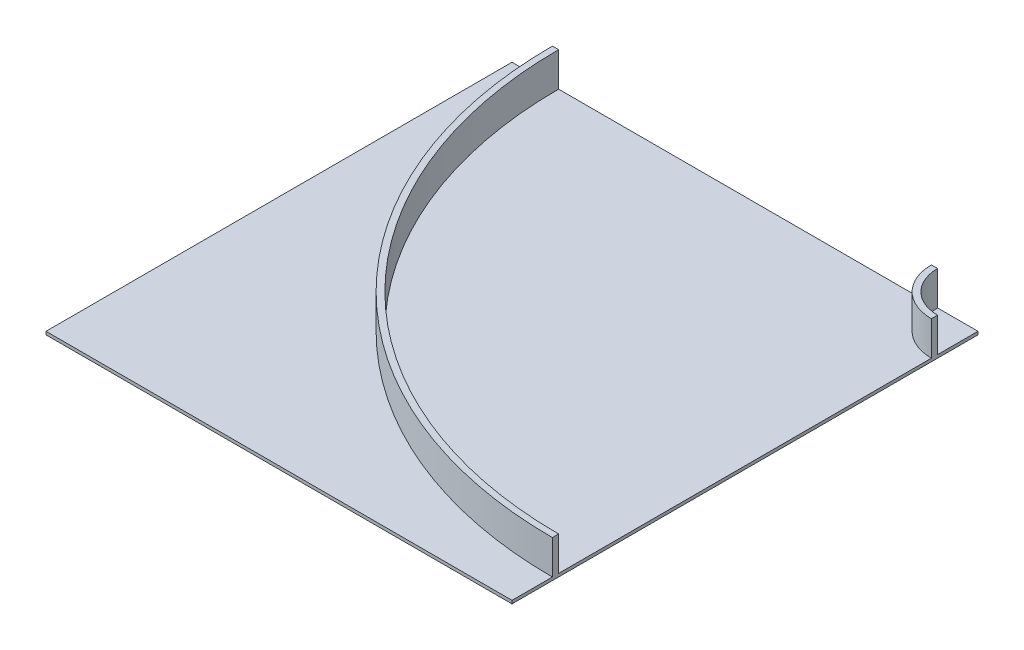
ISO-10303-21;
HEADER;
FILE_DESCRIPTION(('STEP AP214'),'2;1');
FILE_NAME('part.step','',(''),(''),'','','');
FILE_SCHEMA(('AUTOMOTIVE_DESIGN { 1 0 10303 214 1 1 1 1 }'));
ENDSEC;
DATA;
#1=APPLICATION_CONTEXT('core data for automotive mechanical design processes');
#2=APPLICATION_PROTOCOL_DEFINITION('international standard','automotive_design',2000,#1);
#3=PRODUCT_CONTEXT('',#1,'mechanical');
#4=PRODUCT('Part','Part','',(#3));
#5=PRODUCT_RELATED_PRODUCT_CATEGORY('part','',(#4));
#6=PRODUCT_DEFINITION_FORMATION('','',#4);
#7=PRODUCT_DEFINITION_CONTEXT('part definition',#1,'design');
#8=PRODUCT_DEFINITION('design','',#6,#7);
#9=PRODUCT_DEFINITION_SHAPE('','',#8);
#10=(LENGTH_UNIT() NAMED_UNIT(*) SI_UNIT(.MILLI.,.METRE.));
#11=(NAMED_UNIT(*) PLANE_ANGLE_UNIT() SI_UNIT($,.RADIAN.));
#12=(NAMED_UNIT(*) SI_UNIT($,.STERADIAN.) SOLID_ANGLE_UNIT());
#13=UNCERTAINTY_MEASURE_WITH_UNIT(LENGTH_MEASURE(1.E-05),#10,'distance_accuracy_value','');
#14=(GEOMETRIC_REPRESENTATION_CONTEXT(3) GLOBAL_UNCERTAINTY_ASSIGNED_CONTEXT((#13)) GLOBAL_UNIT_ASSIGNED_CONTEXT((#10,
#11,#12)) REPRESENTATION_CONTEXT('',''));
#15=CARTESIAN_POINT('',(0.,0.,0.));
#16=DIRECTION('',(0.,0.,1.));
#17=DIRECTION('',(1.,0.,0.));
#18=AXIS2_PLACEMENT_3D('',#15,#16,#17);
#19=CARTESIAN_POINT('',(0.,10.,0.));
#20=DIRECTION('',(0.,1.,0.));
#21=DIRECTION('',(0.,0.,1.));
#22=AXIS2_PLACEMENT_3D('',#19,#20,#21);
#23=PLANE('',#22);
#24=DIRECTION('',(0.,0.,-1.));
#25=VECTOR('',#24,1.);
#26=CARTESIAN_POINT('',(750.,10.,-750.));
#27=LINE('',#26,#25);
#28=CARTESIAN_POINT('',(750.,10.,599.999999999999));
#29=VERTEX_POINT('',#28);
#30=CARTESIAN_POINT('',(750.,10.,-600.));
#31=VERTEX_POINT('',#30);
#32=EDGE_CURVE('E88',#29,#31,#27,.T.);
#33=ORIENTED_EDGE('',*,*,#32,.T.);
#34=CARTESIAN_POINT('',(750.,10.,-750.));
#35=DIRECTION('',(0.,1.,0.));
#36=DIRECTION('',(0.,0.,1.));
#37=AXIS2_PLACEMENT_3D('',#34,#35,#36);
#38=CIRCLE('',#37,150.);
#39=CARTESIAN_POINT('',(600.,10.,-750.));
#40=VERTEX_POINT('',#39);
#41=EDGE_CURVE('E178',#40,#31,#38,.T.);
#42=ORIENTED_EDGE('',*,*,#41,.F.);
#43=DIRECTION('',(-1.,0.,0.));
#44=VECTOR('',#43,1.);
#45=CARTESIAN_POINT('',(-750.,10.,-750.));
#46=LINE('',#45,#44);
#47=CARTESIAN_POINT('',(-600.,10.,-750.));
#48=VERTEX_POINT('',#47);
#49=EDGE_CURVE('E233',#40,#48,#46,.T.);
#50=ORIENTED_EDGE('',*,*,#49,.T.);
#51=CARTESIAN_POINT('',(750.,10.,-750.));
#52=DIRECTION('',(0.,1.,0.));
#53=DIRECTION('',(0.,0.,1.));
#54=AXIS2_PLACEMENT_3D('',#51,#52,#53);
#55=CIRCLE('',#54,1350.);
#56=EDGE_CURVE('E195',#48,#29,#55,.T.);
#57=ORIENTED_EDGE('',*,*,#56,.T.);
#58=EDGE_LOOP('',(#33,#42,#50,#57));
#59=FACE_BOUND('',#58,.T.);
#60=ADVANCED_FACE('F62',(#59),#23,.T.);
#61=CARTESIAN_POINT('',(750.,10.,-750.));
#62=DIRECTION('',(0.,1.,0.));
#63=DIRECTION('',(0.,0.,1.));
#64=AXIS2_PLACEMENT_3D('',#61,#62,#63);
#65=CIRCLE('',#64,130.);
#66=CARTESIAN_POINT('',(620.,10.,-750.));
#67=VERTEX_POINT('',#66);
#68=CARTESIAN_POINT('',(750.,10.,-620.));
#69=VERTEX_POINT('',#68);
#70=EDGE_CURVE('E80',#67,#69,#65,.T.);
#71=ORIENTED_EDGE('',*,*,#70,.T.);
#72=CARTESIAN_POINT('',(750.,10.,-750.));
#73=VERTEX_POINT('',#72);
#74=EDGE_CURVE('E66',#69,#73,#27,.T.);
#75=ORIENTED_EDGE('',*,*,#74,.T.);
#76=EDGE_CURVE('E234',#73,#67,#46,.T.);
#77=ORIENTED_EDGE('',*,*,#76,.T.);
#78=EDGE_LOOP('',(#71,#75,#77));
#79=FACE_BOUND('',#78,.T.);
#80=ADVANCED_FACE('F289',(#79),#23,.T.);
#81=CARTESIAN_POINT('',(750.,10.,-750.));
#82=DIRECTION('',(-1.,0.,0.));
#83=DIRECTION('',(0.,0.,1.));
#84=AXIS2_PLACEMENT_3D('',#81,#82,#83);
#85=PLANE('',#84);
#86=DIRECTION('',(0.,0.,-1.));
#87=VECTOR('',#86,1.);
#88=CARTESIAN_POINT('',(750.,0.,-750.));
#89=LINE('',#88,#87);
#90=CARTESIAN_POINT('',(750.,0.,750.));
#91=VERTEX_POINT('',#90);
#92=CARTESIAN_POINT('',(750.,0.,-750.));
#93=VERTEX_POINT('',#92);
#94=EDGE_CURVE('E222',#91,#93,#89,.T.);
#95=ORIENTED_EDGE('',*,*,#94,.T.);
#96=DIRECTION('',(0.,-1.,0.));
#97=VECTOR('',#96,1.);
#98=CARTESIAN_POINT('',(750.,10.,-750.));
#99=LINE('',#98,#97);
#100=EDGE_CURVE('E12',#73,#93,#99,.T.);
#101=ORIENTED_EDGE('',*,*,#100,.F.);
#102=ORIENTED_EDGE('',*,*,#74,.F.);
#103=DIRECTION('',(0.,-1.,0.));
#104=VECTOR('',#103,1.);
#105=CARTESIAN_POINT('',(750.,120.,-620.));
#106=LINE('',#105,#104);
#107=CARTESIAN_POINT('',(750.,120.,-620.));
#108=VERTEX_POINT('',#107);
#109=EDGE_CURVE('E184',#108,#69,#106,.T.);
#110=ORIENTED_EDGE('',*,*,#109,.F.);
#111=DIRECTION('',(0.,0.,-1.));
#112=VECTOR('',#111,1.);
#113=CARTESIAN_POINT('',(750.,120.,-1.11022302462516E-13));
#114=LINE('',#113,#112);
#115=CARTESIAN_POINT('',(750.,120.,-600.));
#116=VERTEX_POINT('',#115);
#117=EDGE_CURVE('E176',#116,#108,#114,.T.);
#118=ORIENTED_EDGE('',*,*,#117,.F.);
#119=DIRECTION('',(0.,-1.,0.));
#120=VECTOR('',#119,1.);
#121=CARTESIAN_POINT('',(750.,120.,-600.));
#122=LINE('',#121,#120);
#123=EDGE_CURVE('E187',#116,#31,#122,.T.);
#124=ORIENTED_EDGE('',*,*,#123,.T.);
#125=ORIENTED_EDGE('',*,*,#32,.F.);
#126=DIRECTION('',(0.,-1.,0.));
#127=VECTOR('',#126,1.);
#128=CARTESIAN_POINT('',(750.,120.,599.999999999999));
#129=LINE('',#128,#127);
#130=CARTESIAN_POINT('',(750.,120.,599.999999999999));
#131=VERTEX_POINT('',#130);
#132=EDGE_CURVE('E217',#131,#29,#129,.T.);
#133=ORIENTED_EDGE('',*,*,#132,.F.);
#134=DIRECTION('',(0.,0.,-1.));
#135=VECTOR('',#134,1.);
#136=CARTESIAN_POINT('',(750.,120.,-1.11022302462516E-13));
#137=LINE('',#136,#135);
#138=CARTESIAN_POINT('',(750.,120.,620.));
#139=VERTEX_POINT('',#138);
#140=EDGE_CURVE('E197',#139,#131,#137,.T.);
#141=ORIENTED_EDGE('',*,*,#140,.F.);
#142=DIRECTION('',(0.,-1.,0.));
#143=VECTOR('',#142,1.);
#144=CARTESIAN_POINT('',(750.,120.,620.));
#145=LINE('',#144,#143);
#146=CARTESIAN_POINT('',(750.,10.,620.));
#147=VERTEX_POINT('',#146);
#148=EDGE_CURVE('E213',#139,#147,#145,.T.);
#149=ORIENTED_EDGE('',*,*,#148,.T.);
#150=CARTESIAN_POINT('',(750.,10.,750.));
#151=VERTEX_POINT('',#150);
#152=EDGE_CURVE('E244',#151,#147,#27,.T.);
#153=ORIENTED_EDGE('',*,*,#152,.F.);
#154=DIRECTION('',(0.,-1.,0.));
#155=VECTOR('',#154,1.);
#156=CARTESIAN_POINT('',(750.,10.,750.));
#157=LINE('',#156,#155);
#158=EDGE_CURVE('E251',#151,#91,#157,.T.);
#159=ORIENTED_EDGE('',*,*,#158,.T.);
#160=EDGE_LOOP('',(#95,#101,#102,#110,#118,#124,#125,#133,#141,#149,#153,#159));
#161=FACE_BOUND('',#160,.T.);
#162=ADVANCED_FACE('F64',(#161),#85,.F.);
#163=CARTESIAN_POINT('',(-750.,10.,-750.));
#164=DIRECTION('',(0.,0.,1.));
#165=DIRECTION('',(1.,0.,0.));
#166=AXIS2_PLACEMENT_3D('',#163,#164,#165);
#167=PLANE('',#166);
#168=DIRECTION('',(-1.,0.,0.));
#169=VECTOR('',#168,1.);
#170=CARTESIAN_POINT('',(-750.,0.,-750.));
#171=LINE('',#170,#169);
#172=CARTESIAN_POINT('',(-750.,0.,-750.));
#173=VERTEX_POINT('',#172);
#174=EDGE_CURVE('E259',#93,#173,#171,.T.);
#175=ORIENTED_EDGE('',*,*,#174,.T.);
#176=DIRECTION('',(0.,-1.,0.));
#177=VECTOR('',#176,1.);
#178=CARTESIAN_POINT('',(-750.,10.,-750.));
#179=LINE('',#178,#177);
#180=CARTESIAN_POINT('',(-750.,10.,-750.));
#181=VERTEX_POINT('',#180);
#182=EDGE_CURVE('E72',#181,#173,#179,.T.);
#183=ORIENTED_EDGE('',*,*,#182,.F.);
#184=CARTESIAN_POINT('',(-620.,10.,-750.));
#185=VERTEX_POINT('',#184);
#186=EDGE_CURVE('E210',#185,#181,#46,.T.);
#187=ORIENTED_EDGE('',*,*,#186,.F.);
#188=DIRECTION('',(0.,-1.,0.));
#189=VECTOR('',#188,1.);
#190=CARTESIAN_POINT('',(-620.,120.,-750.));
#191=LINE('',#190,#189);
#192=CARTESIAN_POINT('',(-620.,120.,-750.));
#193=VERTEX_POINT('',#192);
#194=EDGE_CURVE('E216',#193,#185,#191,.T.);
#195=ORIENTED_EDGE('',*,*,#194,.F.);
#196=DIRECTION('',(-1.,0.,0.));
#197=VECTOR('',#196,1.);
#198=CARTESIAN_POINT('',(0.,120.,-750.));
#199=LINE('',#198,#197);
#200=CARTESIAN_POINT('',(-600.,120.,-750.));
#201=VERTEX_POINT('',#200);
#202=EDGE_CURVE('E191',#201,#193,#199,.T.);
#203=ORIENTED_EDGE('',*,*,#202,.F.);
#204=DIRECTION('',(0.,-1.,0.));
#205=VECTOR('',#204,1.);
#206=CARTESIAN_POINT('',(-600.,120.,-750.));
#207=LINE('',#206,#205);
#208=EDGE_CURVE('E202',#201,#48,#207,.T.);
#209=ORIENTED_EDGE('',*,*,#208,.T.);
#210=ORIENTED_EDGE('',*,*,#49,.F.);
#211=DIRECTION('',(0.,-1.,0.));
#212=VECTOR('',#211,1.);
#213=CARTESIAN_POINT('',(600.,120.,-750.));
#214=LINE('',#213,#212);
#215=CARTESIAN_POINT('',(600.,120.,-750.));
#216=VERTEX_POINT('',#215);
#217=EDGE_CURVE('E164',#216,#40,#214,.T.);
#218=ORIENTED_EDGE('',*,*,#217,.F.);
#219=DIRECTION('',(-1.,0.,0.));
#220=VECTOR('',#219,1.);
#221=CARTESIAN_POINT('',(0.,120.,-750.));
#222=LINE('',#221,#220);
#223=CARTESIAN_POINT('',(620.,120.,-750.));
#224=VERTEX_POINT('',#223);
#225=EDGE_CURVE('E167',#224,#216,#222,.T.);
#226=ORIENTED_EDGE('',*,*,#225,.F.);
#227=DIRECTION('',(0.,-1.,0.));
#228=VECTOR('',#227,1.);
#229=CARTESIAN_POINT('',(620.,120.,-750.));
#230=LINE('',#229,#228);
#231=EDGE_CURVE('E155',#224,#67,#230,.T.);
#232=ORIENTED_EDGE('',*,*,#231,.T.);
#233=ORIENTED_EDGE('',*,*,#76,.F.);
#234=ORIENTED_EDGE('',*,*,#100,.T.);
#235=EDGE_LOOP('',(#175,#183,#187,#195,#203,#209,#210,#218,#226,#232,#233,#234));
#236=FACE_BOUND('',#235,.T.);
#237=ADVANCED_FACE('F168',(#236),#167,.F.);
#238=CARTESIAN_POINT('',(-750.,10.,-750.));
#239=DIRECTION('',(1.,0.,0.));
#240=DIRECTION('',(0.,0.,-1.));
#241=AXIS2_PLACEMENT_3D('',#238,#239,#240);
#242=PLANE('',#241);
#243=DIRECTION('',(0.,0.,1.));
#244=VECTOR('',#243,1.);
#245=CARTESIAN_POINT('',(-750.,0.,-750.));
#246=LINE('',#245,#244);
#247=CARTESIAN_POINT('',(-750.,0.,750.));
#248=VERTEX_POINT('',#247);
#249=EDGE_CURVE('E257',#173,#248,#246,.T.);
#250=ORIENTED_EDGE('',*,*,#249,.T.);
#251=DIRECTION('',(0.,-1.,0.));
#252=VECTOR('',#251,1.);
#253=CARTESIAN_POINT('',(-750.,10.,750.));
#254=LINE('',#253,#252);
#255=CARTESIAN_POINT('',(-750.,10.,750.));
#256=VERTEX_POINT('',#255);
#257=EDGE_CURVE('E248',#256,#248,#254,.T.);
#258=ORIENTED_EDGE('',*,*,#257,.F.);
#259=DIRECTION('',(0.,0.,1.));
#260=VECTOR('',#259,1.);
#261=CARTESIAN_POINT('',(-750.,10.,-750.));
#262=LINE('',#261,#260);
#263=EDGE_CURVE('E238',#181,#256,#262,.T.);
#264=ORIENTED_EDGE('',*,*,#263,.F.);
#265=ORIENTED_EDGE('',*,*,#182,.T.);
#266=EDGE_LOOP('',(#250,#258,#264,#265));
#267=FACE_BOUND('',#266,.T.);
#268=ADVANCED_FACE('F271',(#267),#242,.F.);
#269=CARTESIAN_POINT('',(-750.,10.,750.));
#270=DIRECTION('',(0.,0.,-1.));
#271=DIRECTION('',(-1.,0.,0.));
#272=AXIS2_PLACEMENT_3D('',#269,#270,#271);
#273=PLANE('',#272);
#274=DIRECTION('',(1.,0.,0.));
#275=VECTOR('',#274,1.);
#276=CARTESIAN_POINT('',(-750.,0.,750.));
#277=LINE('',#276,#275);
#278=EDGE_CURVE('E255',#248,#91,#277,.T.);
#279=ORIENTED_EDGE('',*,*,#278,.T.);
#280=ORIENTED_EDGE('',*,*,#158,.F.);
#281=DIRECTION('',(1.,0.,0.));
#282=VECTOR('',#281,1.);
#283=CARTESIAN_POINT('',(-750.,10.,750.));
#284=LINE('',#283,#282);
#285=EDGE_CURVE('E254',#256,#151,#284,.T.);
#286=ORIENTED_EDGE('',*,*,#285,.F.);
#287=ORIENTED_EDGE('',*,*,#257,.T.);
#288=EDGE_LOOP('',(#279,#280,#286,#287));
#289=FACE_BOUND('',#288,.T.);
#290=ADVANCED_FACE('F275',(#289),#273,.F.);
#291=CARTESIAN_POINT('',(750.,10.,-750.));
#292=DIRECTION('',(0.,1.,0.));
#293=DIRECTION('',(0.,0.,1.));
#294=AXIS2_PLACEMENT_3D('',#291,#292,#293);
#295=CIRCLE('',#294,1370.);
#296=EDGE_CURVE('E163',#185,#147,#295,.T.);
#297=ORIENTED_EDGE('',*,*,#296,.F.);
#298=ORIENTED_EDGE('',*,*,#186,.T.);
#299=ORIENTED_EDGE('',*,*,#263,.T.);
#300=ORIENTED_EDGE('',*,*,#285,.T.);
#301=ORIENTED_EDGE('',*,*,#152,.T.);
#302=EDGE_LOOP('',(#297,#298,#299,#300,#301));
#303=FACE_BOUND('',#302,.T.);
#304=ADVANCED_FACE('F267',(#303),#23,.T.);
#305=CARTESIAN_POINT('',(0.,0.,0.));
#306=DIRECTION('',(0.,1.,0.));
#307=DIRECTION('',(0.,0.,1.));
#308=AXIS2_PLACEMENT_3D('',#305,#306,#307);
#309=PLANE('',#308);
#310=ORIENTED_EDGE('',*,*,#94,.F.);
#311=ORIENTED_EDGE('',*,*,#278,.F.);
#312=ORIENTED_EDGE('',*,*,#249,.F.);
#313=ORIENTED_EDGE('',*,*,#174,.F.);
#314=EDGE_LOOP('',(#310,#311,#312,#313));
#315=FACE_BOUND('',#314,.T.);
#316=ADVANCED_FACE('F287',(#315),#309,.F.);
#317=CARTESIAN_POINT('',(750.,120.,-750.));
#318=DIRECTION('',(0.,-1.,0.));
#319=DIRECTION('',(0.,0.,-1.));
#320=AXIS2_PLACEMENT_3D('',#317,#318,#319);
#321=CYLINDRICAL_SURFACE('',#320,1370.);
#322=ORIENTED_EDGE('',*,*,#296,.T.);
#323=ORIENTED_EDGE('',*,*,#148,.F.);
#324=CARTESIAN_POINT('',(750.,120.,-750.));
#325=DIRECTION('',(0.,1.,0.));
#326=DIRECTION('',(0.,0.,1.));
#327=AXIS2_PLACEMENT_3D('',#324,#325,#326);
#328=CIRCLE('',#327,1370.);
#329=EDGE_CURVE('E194',#193,#139,#328,.T.);
#330=ORIENTED_EDGE('',*,*,#329,.F.);
#331=ORIENTED_EDGE('',*,*,#194,.T.);
#332=EDGE_LOOP('',(#322,#323,#330,#331));
#333=FACE_BOUND('',#332,.T.);
#334=ADVANCED_FACE('F282',(#333),#321,.T.);
#335=CARTESIAN_POINT('',(750.,120.,-750.));
#336=DIRECTION('',(0.,-1.,0.));
#337=DIRECTION('',(0.,0.,-1.));
#338=AXIS2_PLACEMENT_3D('',#335,#336,#337);
#339=CYLINDRICAL_SURFACE('',#338,1350.);
#340=ORIENTED_EDGE('',*,*,#56,.F.);
#341=ORIENTED_EDGE('',*,*,#208,.F.);
#342=CARTESIAN_POINT('',(750.,120.,-750.));
#343=DIRECTION('',(0.,1.,0.));
#344=DIRECTION('',(0.,0.,1.));
#345=AXIS2_PLACEMENT_3D('',#342,#343,#344);
#346=CIRCLE('',#345,1350.);
#347=EDGE_CURVE('E199',#201,#131,#346,.T.);
#348=ORIENTED_EDGE('',*,*,#347,.T.);
#349=ORIENTED_EDGE('',*,*,#132,.T.);
#350=EDGE_LOOP('',(#340,#341,#348,#349));
#351=FACE_BOUND('',#350,.T.);
#352=ADVANCED_FACE('F365',(#351),#339,.F.);
#353=CARTESIAN_POINT('',(0.,120.,0.));
#354=DIRECTION('',(0.,1.,0.));
#355=DIRECTION('',(0.,0.,1.));
#356=AXIS2_PLACEMENT_3D('',#353,#354,#355);
#357=PLANE('',#356);
#358=ORIENTED_EDGE('',*,*,#202,.T.);
#359=ORIENTED_EDGE('',*,*,#329,.T.);
#360=ORIENTED_EDGE('',*,*,#140,.T.);
#361=ORIENTED_EDGE('',*,*,#347,.F.);
#362=EDGE_LOOP('',(#358,#359,#360,#361));
#363=FACE_BOUND('',#362,.T.);
#364=ADVANCED_FACE('F372',(#363),#357,.T.);
#365=CARTESIAN_POINT('',(750.,120.,-750.));
#366=DIRECTION('',(0.,-1.,0.));
#367=DIRECTION('',(0.,0.,-1.));
#368=AXIS2_PLACEMENT_3D('',#365,#366,#367);
#369=CYLINDRICAL_SURFACE('',#368,130.);
#370=ORIENTED_EDGE('',*,*,#70,.F.);
#371=ORIENTED_EDGE('',*,*,#231,.F.);
#372=CARTESIAN_POINT('',(750.,120.,-750.));
#373=DIRECTION('',(0.,1.,0.));
#374=DIRECTION('',(0.,0.,1.));
#375=AXIS2_PLACEMENT_3D('',#372,#373,#374);
#376=CIRCLE('',#375,130.);
#377=EDGE_CURVE('E160',#224,#108,#376,.T.);
#378=ORIENTED_EDGE('',*,*,#377,.T.);
#379=ORIENTED_EDGE('',*,*,#109,.T.);
#380=EDGE_LOOP('',(#370,#371,#378,#379));
#381=FACE_BOUND('',#380,.T.);
#382=ADVANCED_FACE('F157',(#381),#369,.F.);
#383=CARTESIAN_POINT('',(750.,120.,-750.));
#384=DIRECTION('',(0.,-1.,0.));
#385=DIRECTION('',(0.,0.,-1.));
#386=AXIS2_PLACEMENT_3D('',#383,#384,#385);
#387=CYLINDRICAL_SURFACE('',#386,150.);
#388=ORIENTED_EDGE('',*,*,#41,.T.);
#389=ORIENTED_EDGE('',*,*,#123,.F.);
#390=CARTESIAN_POINT('',(750.,120.,-750.));
#391=DIRECTION('',(0.,1.,0.));
#392=DIRECTION('',(0.,0.,1.));
#393=AXIS2_PLACEMENT_3D('',#390,#391,#392);
#394=CIRCLE('',#393,150.);
#395=EDGE_CURVE('E172',#216,#116,#394,.T.);
#396=ORIENTED_EDGE('',*,*,#395,.F.);
#397=ORIENTED_EDGE('',*,*,#217,.T.);
#398=EDGE_LOOP('',(#388,#389,#396,#397));
#399=FACE_BOUND('',#398,.T.);
#400=ADVANCED_FACE('F389',(#399),#387,.T.);
#401=CARTESIAN_POINT('',(0.,120.,0.));
#402=DIRECTION('',(0.,1.,0.));
#403=DIRECTION('',(0.,0.,1.));
#404=AXIS2_PLACEMENT_3D('',#401,#402,#403);
#405=PLANE('',#404);
#406=ORIENTED_EDGE('',*,*,#377,.F.);
#407=ORIENTED_EDGE('',*,*,#225,.T.);
#408=ORIENTED_EDGE('',*,*,#395,.T.);
#409=ORIENTED_EDGE('',*,*,#117,.T.);
#410=EDGE_LOOP('',(#406,#407,#408,#409));
#411=FACE_BOUND('',#410,.T.);
#412=ADVANCED_FACE('F174',(#411),#405,.T.);
#413=CLOSED_SHELL('',(#60,#80,#162,#237,#268,#290,#304,#316,#334,#352,#364,#382,#400,#412));
#414=MANIFOLD_SOLID_BREP('B2',#413);
#415=ADVANCED_BREP_SHAPE_REPRESENTATION('',(#18,#414),#14);
#416=SHAPE_DEFINITION_REPRESENTATION(#9,#415);
ENDSEC;
END-ISO-10303-21;
